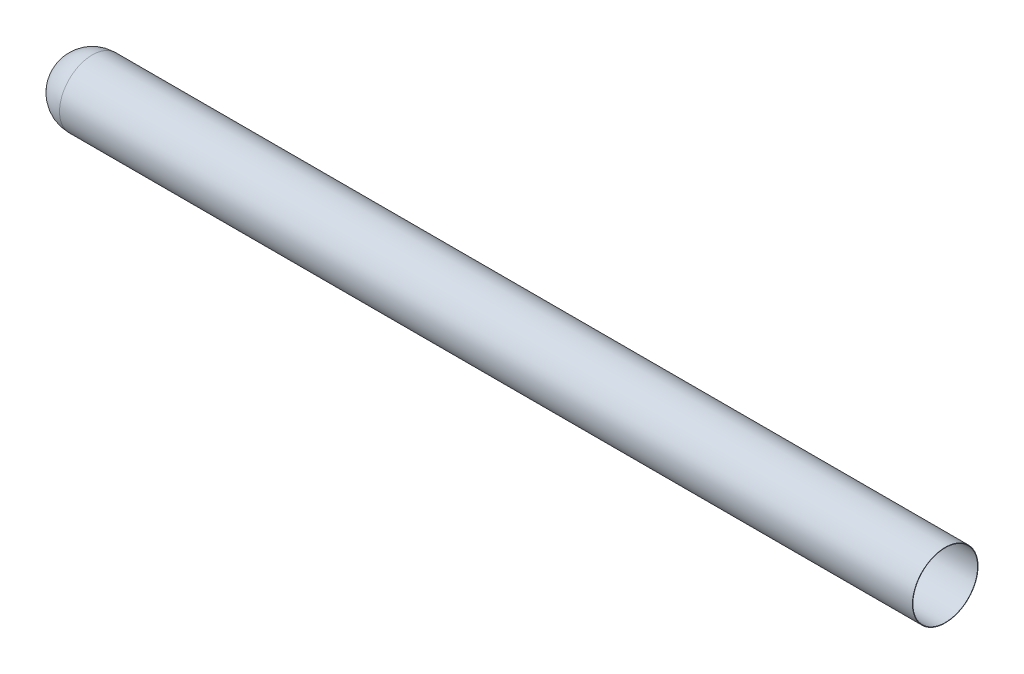
ISO-10303-21;
HEADER;
FILE_DESCRIPTION(('STEP AP214'),'2;1');
FILE_NAME('part.step','',(''),(''),'','','');
FILE_SCHEMA(('AUTOMOTIVE_DESIGN { 1 0 10303 214 1 1 1 1 }'));
ENDSEC;
DATA;
#1=APPLICATION_CONTEXT('core data for automotive mechanical design processes');
#2=APPLICATION_PROTOCOL_DEFINITION('international standard','automotive_design',2000,#1);
#3=PRODUCT_CONTEXT('',#1,'mechanical');
#4=PRODUCT('Part','Part','',(#3));
#5=PRODUCT_RELATED_PRODUCT_CATEGORY('part','',(#4));
#6=PRODUCT_DEFINITION_FORMATION('','',#4);
#7=PRODUCT_DEFINITION_CONTEXT('part definition',#1,'design');
#8=PRODUCT_DEFINITION('design','',#6,#7);
#9=PRODUCT_DEFINITION_SHAPE('','',#8);
#10=(LENGTH_UNIT() NAMED_UNIT(*) SI_UNIT(.MILLI.,.METRE.));
#11=(NAMED_UNIT(*) PLANE_ANGLE_UNIT() SI_UNIT($,.RADIAN.));
#12=(NAMED_UNIT(*) SI_UNIT($,.STERADIAN.) SOLID_ANGLE_UNIT());
#13=UNCERTAINTY_MEASURE_WITH_UNIT(LENGTH_MEASURE(1.E-05),#10,'distance_accuracy_value','');
#14=(GEOMETRIC_REPRESENTATION_CONTEXT(3) GLOBAL_UNCERTAINTY_ASSIGNED_CONTEXT((#13)) GLOBAL_UNIT_ASSIGNED_CONTEXT((#10,
#11,#12)) REPRESENTATION_CONTEXT('',''));
#15=CARTESIAN_POINT('',(0.,0.,0.));
#16=DIRECTION('',(0.,0.,1.));
#17=DIRECTION('',(1.,0.,0.));
#18=AXIS2_PLACEMENT_3D('',#15,#16,#17);
#19=CARTESIAN_POINT('',(250.,0.,0.));
#20=DIRECTION('',(-1.,0.,0.));
#21=DIRECTION('',(0.,0.,1.));
#22=AXIS2_PLACEMENT_3D('',#19,#20,#21);
#23=SPHERICAL_SURFACE('',#22,250.);
#24=CARTESIAN_POINT('',(250.,0.,0.));
#25=DIRECTION('',(-1.,0.,0.));
#26=DIRECTION('',(0.,0.,1.));
#27=AXIS2_PLACEMENT_3D('',#24,#25,#26);
#28=CIRCLE('',#27,250.);
#29=CARTESIAN_POINT('',(250.,0.,250.));
#30=VERTEX_POINT('',#29);
#31=EDGE_CURVE('E45',#30,#30,#28,.T.);
#32=ORIENTED_EDGE('',*,*,#31,.T.);
#33=EDGE_LOOP('',(#32));
#34=FACE_BOUND('',#33,.T.);
#35=ADVANCED_FACE('F31',(#34),#23,.T.);
#36=CARTESIAN_POINT('',(250.,0.,0.));
#37=DIRECTION('',(-1.,0.,0.));
#38=DIRECTION('',(0.,0.,1.));
#39=AXIS2_PLACEMENT_3D('',#36,#37,#38);
#40=SPHERICAL_SURFACE('',#39,246.825);
#41=CARTESIAN_POINT('',(250.,0.,0.));
#42=DIRECTION('',(-1.,0.,0.));
#43=DIRECTION('',(0.,0.,1.));
#44=AXIS2_PLACEMENT_3D('',#41,#42,#43);
#45=CIRCLE('',#44,246.825);
#46=CARTESIAN_POINT('',(250.,0.,246.825));
#47=VERTEX_POINT('',#46);
#48=EDGE_CURVE('E10',#47,#47,#45,.T.);
#49=ORIENTED_EDGE('',*,*,#48,.F.);
#50=EDGE_LOOP('',(#49));
#51=FACE_BOUND('',#50,.T.);
#52=ADVANCED_FACE('F63',(#51),#40,.F.);
#53=CARTESIAN_POINT('',(0.,0.,0.));
#54=DIRECTION('',(-1.,0.,0.));
#55=DIRECTION('',(0.,0.,1.));
#56=AXIS2_PLACEMENT_3D('',#53,#54,#55);
#57=CYLINDRICAL_SURFACE('',#56,246.825);
#58=ORIENTED_EDGE('',*,*,#48,.T.);
#59=EDGE_LOOP('',(#58));
#60=FACE_BOUND('',#59,.T.);
#61=CARTESIAN_POINT('',(6750.,0.,0.));
#62=DIRECTION('',(-1.,0.,0.));
#63=DIRECTION('',(0.,0.,1.));
#64=AXIS2_PLACEMENT_3D('',#61,#62,#63);
#65=CIRCLE('',#64,246.824999999999);
#66=CARTESIAN_POINT('',(6750.,0.,246.824999999999));
#67=VERTEX_POINT('',#66);
#68=EDGE_CURVE('E37',#67,#67,#65,.T.);
#69=ORIENTED_EDGE('',*,*,#68,.F.);
#70=EDGE_LOOP('',(#69));
#71=FACE_BOUND('',#70,.T.);
#72=ADVANCED_FACE('F60',(#60,#71),#57,.F.);
#73=CARTESIAN_POINT('',(6750.,0.,250.));
#74=DIRECTION('',(1.,0.,0.));
#75=DIRECTION('',(0.,0.,-1.));
#76=AXIS2_PLACEMENT_3D('',#73,#74,#75);
#77=PLANE('',#76);
#78=ORIENTED_EDGE('',*,*,#68,.T.);
#79=EDGE_LOOP('',(#78));
#80=FACE_BOUND('',#79,.T.);
#81=CARTESIAN_POINT('',(6750.,0.,0.));
#82=DIRECTION('',(-1.,0.,0.));
#83=DIRECTION('',(0.,0.,1.));
#84=AXIS2_PLACEMENT_3D('',#81,#82,#83);
#85=CIRCLE('',#84,250.);
#86=CARTESIAN_POINT('',(6750.,0.,250.));
#87=VERTEX_POINT('',#86);
#88=EDGE_CURVE('E41',#87,#87,#85,.T.);
#89=ORIENTED_EDGE('',*,*,#88,.F.);
#90=EDGE_LOOP('',(#89));
#91=FACE_BOUND('',#90,.T.);
#92=ADVANCED_FACE('F54',(#80,#91),#77,.T.);
#93=CARTESIAN_POINT('',(0.,0.,0.));
#94=DIRECTION('',(-1.,0.,0.));
#95=DIRECTION('',(0.,0.,1.));
#96=AXIS2_PLACEMENT_3D('',#93,#94,#95);
#97=CYLINDRICAL_SURFACE('',#96,250.);
#98=ORIENTED_EDGE('',*,*,#88,.T.);
#99=EDGE_LOOP('',(#98));
#100=FACE_BOUND('',#99,.T.);
#101=ORIENTED_EDGE('',*,*,#31,.F.);
#102=EDGE_LOOP('',(#101));
#103=FACE_BOUND('',#102,.T.);
#104=ADVANCED_FACE('F52',(#100,#103),#97,.T.);
#105=CLOSED_SHELL('',(#35,#52,#72,#92,#104));
#106=MANIFOLD_SOLID_BREP('B2',#105);
#107=ADVANCED_BREP_SHAPE_REPRESENTATION('',(#18,#106),#14);
#108=SHAPE_DEFINITION_REPRESENTATION(#9,#107);
ENDSEC;
END-ISO-10303-21;
